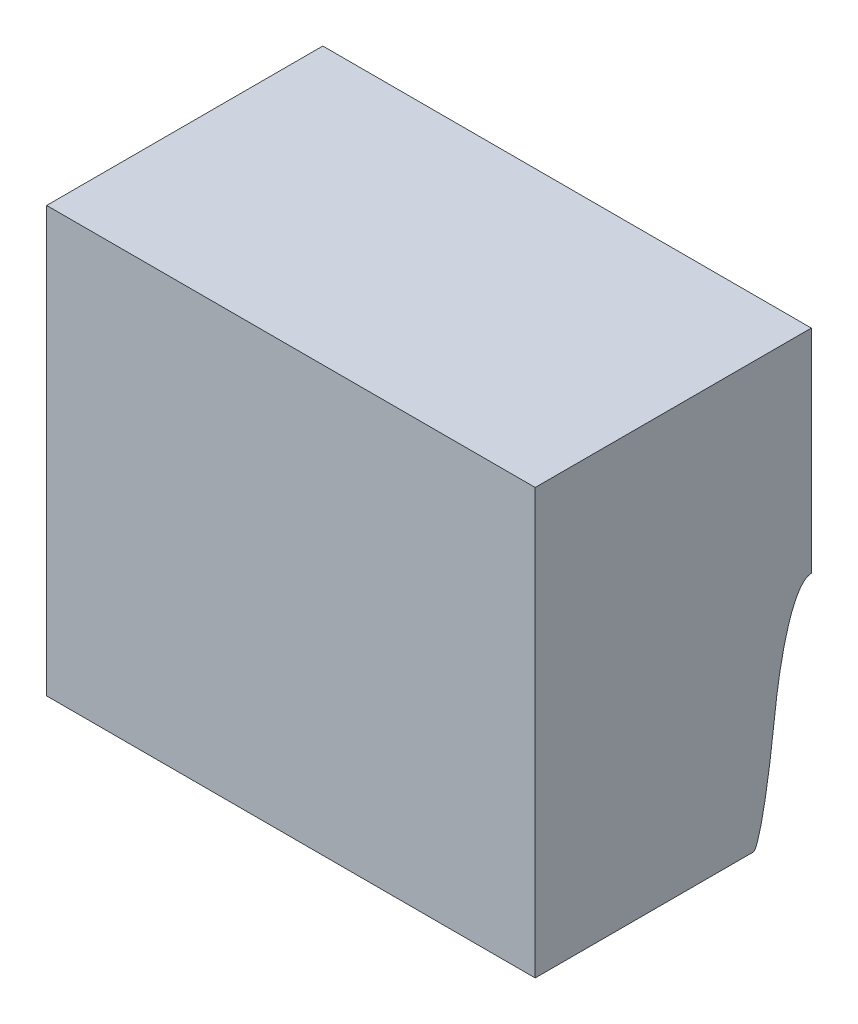
ISO-10303-21;
HEADER;
FILE_DESCRIPTION(('STEP AP214'),'2;1');
FILE_NAME('part.step','',(''),(''),'','','');
FILE_SCHEMA(('AUTOMOTIVE_DESIGN { 1 0 10303 214 1 1 1 1 }'));
ENDSEC;
DATA;
#1=APPLICATION_CONTEXT('core data for automotive mechanical design processes');
#2=APPLICATION_PROTOCOL_DEFINITION('international standard','automotive_design',2000,#1);
#3=PRODUCT_CONTEXT('',#1,'mechanical');
#4=PRODUCT('Part','Part','',(#3));
#5=PRODUCT_RELATED_PRODUCT_CATEGORY('part','',(#4));
#6=PRODUCT_DEFINITION_FORMATION('','',#4);
#7=PRODUCT_DEFINITION_CONTEXT('part definition',#1,'design');
#8=PRODUCT_DEFINITION('design','',#6,#7);
#9=PRODUCT_DEFINITION_SHAPE('','',#8);
#10=(LENGTH_UNIT() NAMED_UNIT(*) SI_UNIT(.MILLI.,.METRE.));
#11=(NAMED_UNIT(*) PLANE_ANGLE_UNIT() SI_UNIT($,.RADIAN.));
#12=(NAMED_UNIT(*) SI_UNIT($,.STERADIAN.) SOLID_ANGLE_UNIT());
#13=UNCERTAINTY_MEASURE_WITH_UNIT(LENGTH_MEASURE(1.E-05),#10,'distance_accuracy_value','');
#14=(GEOMETRIC_REPRESENTATION_CONTEXT(3) GLOBAL_UNCERTAINTY_ASSIGNED_CONTEXT((#13)) GLOBAL_UNIT_ASSIGNED_CONTEXT((#10,
#11,#12)) REPRESENTATION_CONTEXT('',''));
#15=CARTESIAN_POINT('',(0.,0.,0.));
#16=DIRECTION('',(0.,0.,1.));
#17=DIRECTION('',(1.,0.,0.));
#18=AXIS2_PLACEMENT_3D('',#15,#16,#17);
#19=CARTESIAN_POINT('',(0.,0.,26.));
#20=DIRECTION('',(0.,0.,1.));
#21=DIRECTION('',(1.,0.,0.));
#22=AXIS2_PLACEMENT_3D('',#19,#20,#21);
#23=PLANE('',#22);
#24=DIRECTION('',(1.,0.,0.));
#25=VECTOR('',#24,1.);
#26=CARTESIAN_POINT('',(0.,124.,26.));
#27=LINE('',#26,#25);
#28=CARTESIAN_POINT('',(45.,124.,26.));
#29=VERTEX_POINT('',#28);
#30=CARTESIAN_POINT('',(68.,124.,26.));
#31=VERTEX_POINT('',#30);
#32=EDGE_CURVE('E53',#29,#31,#27,.T.);
#33=ORIENTED_EDGE('',*,*,#32,.T.);
#34=DIRECTION('',(0.,1.,0.));
#35=VECTOR('',#34,1.);
#36=CARTESIAN_POINT('',(68.,124.,26.));
#37=LINE('',#36,#35);
#38=CARTESIAN_POINT('',(68.,114.,26.));
#39=VERTEX_POINT('',#38);
#40=EDGE_CURVE('E436',#39,#31,#37,.T.);
#41=ORIENTED_EDGE('',*,*,#40,.F.);
#42=CARTESIAN_POINT('',(43.85,114.,26.));
#43=CARTESIAN_POINT('',(52.2833333333333,114.,26.));
#44=CARTESIAN_POINT('',(60.7166666666667,114.,26.));
#45=CARTESIAN_POINT('',(69.15,114.,26.));
#46=(BOUNDED_CURVE() B_SPLINE_CURVE(3,(#42,#43,#44,#45),.UNSPECIFIED.,.F.,
.F.) B_SPLINE_CURVE_WITH_KNOTS((4,4),(-0.02415,0.00115),
.UNSPECIFIED.) CURVE() GEOMETRIC_REPRESENTATION_ITEM() RATIONAL_B_SPLINE_CURVE((1.,1.,1.,1.)) REPRESENTATION_ITEM(''));
#47=CARTESIAN_POINT('',(45.,114.,26.));
#48=VERTEX_POINT('',#47);
#49=EDGE_CURVE('E13',#39,#48,#46,.F.);
#50=ORIENTED_EDGE('',*,*,#49,.T.);
#51=DIRECTION('',(0.,-1.,0.));
#52=VECTOR('',#51,1.);
#53=CARTESIAN_POINT('',(45.,124.,26.));
#54=LINE('',#53,#52);
#55=EDGE_CURVE('E60',#29,#48,#54,.T.);
#56=ORIENTED_EDGE('',*,*,#55,.F.);
#57=EDGE_LOOP('',(#33,#41,#50,#56));
#58=FACE_BOUND('',#57,.T.);
#59=ADVANCED_FACE('F44',(#58),#23,.F.);
#60=CARTESIAN_POINT('',(0.,104.,0.));
#61=DIRECTION('',(0.,-1.,0.));
#62=DIRECTION('',(0.,0.,-1.));
#63=AXIS2_PLACEMENT_3D('',#60,#61,#62);
#64=PLANE('',#63);
#65=DIRECTION('',(0.,0.,-1.));
#66=VECTOR('',#65,1.);
#67=CARTESIAN_POINT('',(45.,104.,39.));
#68=LINE('',#67,#66);
#69=CARTESIAN_POINT('',(45.,104.,39.));
#70=VERTEX_POINT('',#69);
#71=CARTESIAN_POINT('',(45.,104.,28.7385001548612));
#72=VERTEX_POINT('',#71);
#73=EDGE_CURVE('E111',#70,#72,#68,.T.);
#74=ORIENTED_EDGE('',*,*,#73,.T.);
#75=CARTESIAN_POINT('',(69.15,104.,28.7385001548569));
#76=CARTESIAN_POINT('',(60.7166666666667,104.,28.7385001546667));
#77=CARTESIAN_POINT('',(52.2833333333333,104.,28.7385001549008));
#78=CARTESIAN_POINT('',(43.85,104.,28.7385001548569));
#79=(BOUNDED_CURVE() B_SPLINE_CURVE(3,(#75,#76,#77,#78),.UNSPECIFIED.,.F.,
.F.) B_SPLINE_CURVE_WITH_KNOTS((4,4),(-0.01265,0.01265),
.UNSPECIFIED.) CURVE() GEOMETRIC_REPRESENTATION_ITEM() RATIONAL_B_SPLINE_CURVE((1.,1.,1.,1.)) REPRESENTATION_ITEM(''));
#80=CARTESIAN_POINT('',(68.,104.,28.7385001548336));
#81=VERTEX_POINT('',#80);
#82=EDGE_CURVE('E108',#72,#81,#79,.F.);
#83=ORIENTED_EDGE('',*,*,#82,.T.);
#84=DIRECTION('',(0.,0.,1.));
#85=VECTOR('',#84,1.);
#86=CARTESIAN_POINT('',(68.,104.,39.));
#87=LINE('',#86,#85);
#88=CARTESIAN_POINT('',(68.,104.,39.));
#89=VERTEX_POINT('',#88);
#90=EDGE_CURVE('E100',#81,#89,#87,.T.);
#91=ORIENTED_EDGE('',*,*,#90,.T.);
#92=DIRECTION('',(-1.,0.,0.));
#93=VECTOR('',#92,1.);
#94=CARTESIAN_POINT('',(45.,104.,39.));
#95=LINE('',#94,#93);
#96=EDGE_CURVE('E105',#89,#70,#95,.T.);
#97=ORIENTED_EDGE('',*,*,#96,.T.);
#98=EDGE_LOOP('',(#74,#83,#91,#97));
#99=FACE_BOUND('',#98,.T.);
#100=ADVANCED_FACE('F103',(#99),#64,.T.);
#101=CARTESIAN_POINT('',(0.,0.,39.));
#102=DIRECTION('',(0.,0.,1.));
#103=DIRECTION('',(1.,0.,0.));
#104=AXIS2_PLACEMENT_3D('',#101,#102,#103);
#105=PLANE('',#104);
#106=DIRECTION('',(0.,-1.,0.));
#107=VECTOR('',#106,1.);
#108=CARTESIAN_POINT('',(45.,124.,39.));
#109=LINE('',#108,#107);
#110=CARTESIAN_POINT('',(45.,124.,39.));
#111=VERTEX_POINT('',#110);
#112=EDGE_CURVE('E122',#111,#70,#109,.T.);
#113=ORIENTED_EDGE('',*,*,#112,.T.);
#114=ORIENTED_EDGE('',*,*,#96,.F.);
#115=DIRECTION('',(0.,1.,0.));
#116=VECTOR('',#115,1.);
#117=CARTESIAN_POINT('',(68.,124.,39.));
#118=LINE('',#117,#116);
#119=CARTESIAN_POINT('',(68.,124.,39.));
#120=VERTEX_POINT('',#119);
#121=EDGE_CURVE('E114',#89,#120,#118,.T.);
#122=ORIENTED_EDGE('',*,*,#121,.T.);
#123=DIRECTION('',(-1.,0.,0.));
#124=VECTOR('',#123,1.);
#125=CARTESIAN_POINT('',(45.,124.,39.));
#126=LINE('',#125,#124);
#127=EDGE_CURVE('E121',#120,#111,#126,.T.);
#128=ORIENTED_EDGE('',*,*,#127,.T.);
#129=EDGE_LOOP('',(#113,#114,#122,#128));
#130=FACE_BOUND('',#129,.T.);
#131=ADVANCED_FACE('F124',(#130),#105,.T.);
#132=CARTESIAN_POINT('',(0.,124.,10.));
#133=DIRECTION('',(0.,1.,0.));
#134=DIRECTION('',(0.,0.,1.));
#135=AXIS2_PLACEMENT_3D('',#132,#133,#134);
#136=PLANE('',#135);
#137=ORIENTED_EDGE('',*,*,#32,.F.);
#138=DIRECTION('',(0.,0.,-1.));
#139=VECTOR('',#138,1.);
#140=CARTESIAN_POINT('',(45.,124.,39.));
#141=LINE('',#140,#139);
#142=EDGE_CURVE('E130',#111,#29,#141,.T.);
#143=ORIENTED_EDGE('',*,*,#142,.F.);
#144=ORIENTED_EDGE('',*,*,#127,.F.);
#145=DIRECTION('',(0.,0.,-1.));
#146=VECTOR('',#145,1.);
#147=CARTESIAN_POINT('',(68.,124.,39.));
#148=LINE('',#147,#146);
#149=EDGE_CURVE('E118',#120,#31,#148,.T.);
#150=ORIENTED_EDGE('',*,*,#149,.T.);
#151=EDGE_LOOP('',(#137,#143,#144,#150));
#152=FACE_BOUND('',#151,.T.);
#153=ADVANCED_FACE('F188',(#152),#136,.T.);
#154=CARTESIAN_POINT('',(45.,124.,39.));
#155=DIRECTION('',(1.,0.,0.));
#156=DIRECTION('',(0.,0.,-1.));
#157=AXIS2_PLACEMENT_3D('',#154,#155,#156);
#158=PLANE('',#157);
#159=ORIENTED_EDGE('',*,*,#142,.T.);
#160=ORIENTED_EDGE('',*,*,#55,.T.);
#161=CARTESIAN_POINT('',(45.,104.,28.));
#162=CARTESIAN_POINT('',(45.,114.,28.0000000000001));
#163=CARTESIAN_POINT('',(45.,114.,26.));
#164=(BOUNDED_CURVE() B_SPLINE_CURVE(2,(#161,#162,#163),.UNSPECIFIED.,.F.,
.F.) B_SPLINE_CURVE_WITH_KNOTS((3,3),(0.,1.),
.UNSPECIFIED.) CURVE() GEOMETRIC_REPRESENTATION_ITEM() RATIONAL_B_SPLINE_CURVE((1.,
0.707106781186545,1.)) REPRESENTATION_ITEM(''));
#165=CARTESIAN_POINT('',(45.,108.888621021373,27.7447359640077));
#166=VERTEX_POINT('',#165);
#167=EDGE_CURVE('E452',#48,#166,#164,.F.);
#168=ORIENTED_EDGE('',*,*,#167,.T.);
#169=CARTESIAN_POINT('',(45.,104.,28.7385001548612));
#170=CARTESIAN_POINT('',(45.,103.999999999983,28.292628431377));
#171=CARTESIAN_POINT('',(45.,108.888619487019,27.7447223218741));
#172=(BOUNDED_CURVE() B_SPLINE_CURVE(2,(#169,#170,#171),.UNSPECIFIED.,.F.,
.F.) B_SPLINE_CURVE_WITH_KNOTS((3,3),(0.,1.),
.UNSPECIFIED.) CURVE() GEOMETRIC_REPRESENTATION_ITEM() RATIONAL_B_SPLINE_CURVE((1.,
0.745446347154539,1.)) REPRESENTATION_ITEM(''));
#173=EDGE_CURVE('E441',#166,#72,#172,.F.);
#174=ORIENTED_EDGE('',*,*,#173,.T.);
#175=ORIENTED_EDGE('',*,*,#73,.F.);
#176=ORIENTED_EDGE('',*,*,#112,.F.);
#177=EDGE_LOOP('',(#159,#160,#168,#174,#175,#176));
#178=FACE_BOUND('',#177,.T.);
#179=ADVANCED_FACE('F153',(#178),#158,.F.);
#180=CARTESIAN_POINT('',(69.15,108.888619487028,27.7447223218731));
#181=CARTESIAN_POINT('',(60.7166666666667,108.888619486818,27.7447223218966));
#182=CARTESIAN_POINT('',(52.2833333333333,108.888619486965,27.7447223218801));
#183=CARTESIAN_POINT('',(43.85,108.888619487028,27.7447223218731));
#184=CARTESIAN_POINT('',(69.15,104.,28.2926284313862));
#185=CARTESIAN_POINT('',(60.7166666666667,103.999999999532,28.2926284289138));
#186=CARTESIAN_POINT('',(52.2833333333333,103.999999999883,28.29262843143));
#187=CARTESIAN_POINT('',(43.85,104.,28.2926284313862));
#188=CARTESIAN_POINT('',(69.15,104.,28.7385001548569));
#189=CARTESIAN_POINT('',(60.7166666666667,104.,28.7385001546667));
#190=CARTESIAN_POINT('',(52.2833333333333,104.,28.7385001549008));
#191=CARTESIAN_POINT('',(43.85,104.,28.7385001548569));
#192=(BOUNDED_SURFACE() B_SPLINE_SURFACE(2,3,((#180,#181,#182,#183),(#184,#185,#186,#187),(#188,
#189,#190,#191)),.UNSPECIFIED.,.F.,.F.,.F.) B_SPLINE_SURFACE_WITH_KNOTS((3,3),(4,4),(0.,1.),
(-0.01265,0.01265),
.UNSPECIFIED.) GEOMETRIC_REPRESENTATION_ITEM() RATIONAL_B_SPLINE_SURFACE(((1.,1.,1.,1.),
(0.745446347154539,0.745446347154539,0.745446347154539,0.745446347154539),(1.,1.,1.,1.))) REPRESENTATION_ITEM('') SURFACE());
#193=CARTESIAN_POINT('',(68.,108.888619487002,27.744722321876));
#194=CARTESIAN_POINT('',(67.0416666666667,108.888619487002,27.7447223218759));
#195=CARTESIAN_POINT('',(66.0833333333333,108.888619487003,27.7447223218759));
#196=CARTESIAN_POINT('',(64.1666666666667,108.888619487004,27.7447223218757));
#197=CARTESIAN_POINT('',(63.2083333333333,108.888619487005,27.7447223218756));
#198=CARTESIAN_POINT('',(61.2916666666667,108.888619487007,27.7447223218755));
#199=CARTESIAN_POINT('',(60.3333333333333,108.888619487007,27.7447223218754));
#200=CARTESIAN_POINT('',(58.4166666666667,108.888619487009,27.7447223218752));
#201=CARTESIAN_POINT('',(57.4583333333333,108.888619487009,27.7447223218751));
#202=CARTESIAN_POINT('',(55.5416666666667,108.888619487011,27.744722321875));
#203=CARTESIAN_POINT('',(54.5833333333334,108.888619487012,27.7447223218749));
#204=CARTESIAN_POINT('',(52.6666666666667,108.888619487013,27.7447223218747));
#205=CARTESIAN_POINT('',(51.7083333333334,108.888619487014,27.7447223218746));
#206=CARTESIAN_POINT('',(49.7916666666667,108.888619487015,27.7447223218745));
#207=CARTESIAN_POINT('',(48.8333333333334,108.888619487016,27.7447223218744));
#208=CARTESIAN_POINT('',(46.9166666666667,108.888619487017,27.7447223218742));
#209=CARTESIAN_POINT('',(45.9583333333333,108.888619487018,27.7447223218742));
#210=CARTESIAN_POINT('',(45.,108.888619487019,27.7447223218741));
#211=B_SPLINE_CURVE_WITH_KNOTS('',3,(#193,#194,#195,#196,#197,#198,#199,#200,#201,#202,#203,
#204,#205,#206,#207,#208,#209,#210),.UNSPECIFIED.,.F.,.F.,(4,2,2,2,2,2,2,2,4),(0.,
2.87500000000002,5.75000000000001,8.62500000000001,11.5,14.375,17.25,20.125,23.),.UNSPECIFIED.);
#212=CARTESIAN_POINT('',(68.,108.888621052951,27.7447363460782));
#213=VERTEX_POINT('',#212);
#214=EDGE_CURVE('E170',#213,#166,#211,.T.);
#215=CARTESIAN_POINT('',(68.,108.888619487001,27.744722321876));
#216=CARTESIAN_POINT('',(68.,103.999999999941,28.2926284310792));
#217=CARTESIAN_POINT('',(68.,104.,28.7385001548336));
#218=(BOUNDED_CURVE() B_SPLINE_CURVE(2,(#215,#216,#217),.UNSPECIFIED.,.F.,
.F.) B_SPLINE_CURVE_WITH_KNOTS((3,3),(0.,1.),
.UNSPECIFIED.) CURVE() GEOMETRIC_REPRESENTATION_ITEM() RATIONAL_B_SPLINE_CURVE((1.,
0.745446347154539,1.)) REPRESENTATION_ITEM(''));
#219=EDGE_CURVE('E488',#81,#213,#218,.F.);
#220=ORIENTED_EDGE('',*,*,#173,.F.);
#221=ORIENTED_EDGE('',*,*,#214,.F.);
#222=ORIENTED_EDGE('',*,*,#219,.F.);
#223=ORIENTED_EDGE('',*,*,#82,.F.);
#224=EDGE_LOOP('',(#220,#221,#222,#223));
#225=FACE_BOUND('',#224,.T.);
#226=ADVANCED_FACE('F151',(#225),#192,.T.);
#227=CARTESIAN_POINT('',(68.,124.,39.));
#228=DIRECTION('',(-1.,0.,0.));
#229=DIRECTION('',(0.,0.,1.));
#230=AXIS2_PLACEMENT_3D('',#227,#228,#229);
#231=PLANE('',#230);
#232=CARTESIAN_POINT('',(68.,114.,26.));
#233=CARTESIAN_POINT('',(68.,114.,28.0000000000001));
#234=CARTESIAN_POINT('',(68.,104.,28.));
#235=(BOUNDED_CURVE() B_SPLINE_CURVE(2,(#232,#233,#234),.UNSPECIFIED.,.F.,
.F.) B_SPLINE_CURVE_WITH_KNOTS((3,3),(0.,1.),
.UNSPECIFIED.) CURVE() GEOMETRIC_REPRESENTATION_ITEM() RATIONAL_B_SPLINE_CURVE((1.,
0.707106781186545,1.)) REPRESENTATION_ITEM(''));
#236=EDGE_CURVE('E133',#213,#39,#235,.F.);
#237=ORIENTED_EDGE('',*,*,#236,.T.);
#238=ORIENTED_EDGE('',*,*,#40,.T.);
#239=ORIENTED_EDGE('',*,*,#149,.F.);
#240=ORIENTED_EDGE('',*,*,#121,.F.);
#241=ORIENTED_EDGE('',*,*,#90,.F.);
#242=ORIENTED_EDGE('',*,*,#219,.T.);
#243=EDGE_LOOP('',(#237,#238,#239,#240,#241,#242));
#244=FACE_BOUND('',#243,.T.);
#245=ADVANCED_FACE('F116',(#244),#231,.F.);
#246=CARTESIAN_POINT('',(69.15,114.,26.));
#247=CARTESIAN_POINT('',(60.7166666666667,114.,26.));
#248=CARTESIAN_POINT('',(52.2833333333333,114.,26.));
#249=CARTESIAN_POINT('',(43.85,114.,26.));
#250=CARTESIAN_POINT('',(69.15,114.,28.0000000000001));
#251=CARTESIAN_POINT('',(60.7166666666666,114.,28.0000000000001));
#252=CARTESIAN_POINT('',(52.2833333333334,114.,28.0000000000001));
#253=CARTESIAN_POINT('',(43.85,114.,28.0000000000001));
#254=CARTESIAN_POINT('',(69.15,104.,28.));
#255=CARTESIAN_POINT('',(60.7166666666667,104.,28.));
#256=CARTESIAN_POINT('',(52.2833333333333,104.,28.));
#257=CARTESIAN_POINT('',(43.85,104.,28.));
#258=(BOUNDED_SURFACE() B_SPLINE_SURFACE(2,3,((#246,#247,#248,#249),(#250,#251,#252,#253),(#254,
#255,#256,#257)),.UNSPECIFIED.,.F.,.F.,.F.) B_SPLINE_SURFACE_WITH_KNOTS((3,3),(4,4),(0.,1.),
(-0.02415,0.00115),
.UNSPECIFIED.) GEOMETRIC_REPRESENTATION_ITEM() RATIONAL_B_SPLINE_SURFACE(((1.,1.,1.,1.),
(0.707106781186545,0.707106781186545,0.707106781186545,0.707106781186545),(1.,1.,1.,1.))) REPRESENTATION_ITEM('') SURFACE());
#259=ORIENTED_EDGE('',*,*,#236,.F.);
#260=ORIENTED_EDGE('',*,*,#214,.T.);
#261=ORIENTED_EDGE('',*,*,#167,.F.);
#262=ORIENTED_EDGE('',*,*,#49,.F.);
#263=EDGE_LOOP('',(#259,#260,#261,#262));
#264=FACE_BOUND('',#263,.T.);
#265=ADVANCED_FACE('F150',(#264),#258,.T.);
#266=CLOSED_SHELL('',(#59,#100,#131,#153,#179,#226,#245,#265));
#267=MANIFOLD_SOLID_BREP('B2',#266);
#268=ADVANCED_BREP_SHAPE_REPRESENTATION('',(#18,#267),#14);
#269=SHAPE_DEFINITION_REPRESENTATION(#9,#268);
ENDSEC;
END-ISO-10303-21;
